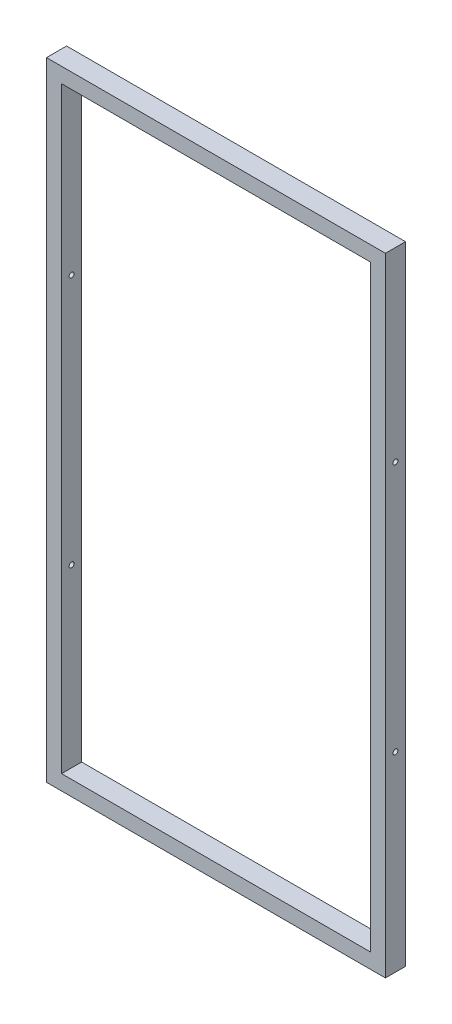
ISO-10303-21;
HEADER;
FILE_DESCRIPTION(('STEP AP214'),'2;1');
FILE_NAME('part.step','',(''),(''),'','','');
FILE_SCHEMA(('AUTOMOTIVE_DESIGN { 1 0 10303 214 1 1 1 1 }'));
ENDSEC;
DATA;
#1=APPLICATION_CONTEXT('core data for automotive mechanical design processes');
#2=APPLICATION_PROTOCOL_DEFINITION('international standard','automotive_design',2000,#1);
#3=PRODUCT_CONTEXT('',#1,'mechanical');
#4=PRODUCT('Part','Part','',(#3));
#5=PRODUCT_RELATED_PRODUCT_CATEGORY('part','',(#4));
#6=PRODUCT_DEFINITION_FORMATION('','',#4);
#7=PRODUCT_DEFINITION_CONTEXT('part definition',#1,'design');
#8=PRODUCT_DEFINITION('design','',#6,#7);
#9=PRODUCT_DEFINITION_SHAPE('','',#8);
#10=(LENGTH_UNIT() NAMED_UNIT(*) SI_UNIT(.MILLI.,.METRE.));
#11=(NAMED_UNIT(*) PLANE_ANGLE_UNIT() SI_UNIT($,.RADIAN.));
#12=(NAMED_UNIT(*) SI_UNIT($,.STERADIAN.) SOLID_ANGLE_UNIT());
#13=UNCERTAINTY_MEASURE_WITH_UNIT(LENGTH_MEASURE(1.E-05),#10,'distance_accuracy_value','');
#14=(GEOMETRIC_REPRESENTATION_CONTEXT(3) GLOBAL_UNCERTAINTY_ASSIGNED_CONTEXT((#13)) GLOBAL_UNIT_ASSIGNED_CONTEXT((#10,
#11,#12)) REPRESENTATION_CONTEXT('',''));
#15=CARTESIAN_POINT('',(0.,0.,0.));
#16=DIRECTION('',(0.,0.,1.));
#17=DIRECTION('',(1.,0.,0.));
#18=AXIS2_PLACEMENT_3D('',#15,#16,#17);
#19=CARTESIAN_POINT('',(0.,0.,40.));
#20=DIRECTION('',(0.,0.,1.));
#21=DIRECTION('',(1.,0.,0.));
#22=AXIS2_PLACEMENT_3D('',#19,#20,#21);
#23=PLANE('',#22);
#24=DIRECTION('',(-1.,0.,0.));
#25=VECTOR('',#24,1.);
#26=CARTESIAN_POINT('',(604.301582524873,1211.13152818773,40.));
#27=LINE('',#26,#25);
#28=CARTESIAN_POINT('',(604.301582524873,1211.13152818773,40.));
#29=VERTEX_POINT('',#28);
#30=CARTESIAN_POINT('',(-70.6984174751271,1211.13152818773,40.));
#31=VERTEX_POINT('',#30);
#32=EDGE_CURVE('E141',#29,#31,#27,.T.);
#33=ORIENTED_EDGE('',*,*,#32,.T.);
#34=DIRECTION('',(0.,-1.,0.));
#35=VECTOR('',#34,1.);
#36=CARTESIAN_POINT('',(-70.6984174751271,1211.13152818773,40.));
#37=LINE('',#36,#35);
#38=CARTESIAN_POINT('',(-70.6984174751269,-38.8684718122674,40.));
#39=VERTEX_POINT('',#38);
#40=EDGE_CURVE('E144',#31,#39,#37,.T.);
#41=ORIENTED_EDGE('',*,*,#40,.T.);
#42=DIRECTION('',(1.,0.,0.));
#43=VECTOR('',#42,1.);
#44=CARTESIAN_POINT('',(-70.6984174751269,-38.8684718122674,40.));
#45=LINE('',#44,#43);
#46=CARTESIAN_POINT('',(604.301582524873,-38.8684718122674,40.));
#47=VERTEX_POINT('',#46);
#48=EDGE_CURVE('E147',#39,#47,#45,.T.);
#49=ORIENTED_EDGE('',*,*,#48,.T.);
#50=DIRECTION('',(0.,1.,0.));
#51=VECTOR('',#50,1.);
#52=CARTESIAN_POINT('',(604.301582524873,-38.8684718122674,40.));
#53=LINE('',#52,#51);
#54=EDGE_CURVE('E149',#47,#29,#53,.T.);
#55=ORIENTED_EDGE('',*,*,#54,.T.);
#56=EDGE_LOOP('',(#33,#41,#49,#55));
#57=FACE_BOUND('',#56,.T.);
#58=DIRECTION('',(0.,-1.,0.));
#59=VECTOR('',#58,1.);
#60=CARTESIAN_POINT('',(-40.6984174751271,1181.13152818773,40.));
#61=LINE('',#60,#59);
#62=CARTESIAN_POINT('',(-40.6984174751271,1181.13152818773,40.));
#63=VERTEX_POINT('',#62);
#64=CARTESIAN_POINT('',(-40.6984174751269,-8.86847181226735,40.));
#65=VERTEX_POINT('',#64);
#66=EDGE_CURVE('E111',#63,#65,#61,.T.);
#67=ORIENTED_EDGE('',*,*,#66,.F.);
#68=DIRECTION('',(-1.,0.,0.));
#69=VECTOR('',#68,1.);
#70=CARTESIAN_POINT('',(574.301582524873,1181.13152818773,40.));
#71=LINE('',#70,#69);
#72=CARTESIAN_POINT('',(574.301582524873,1181.13152818773,40.));
#73=VERTEX_POINT('',#72);
#74=EDGE_CURVE('E103',#73,#63,#71,.T.);
#75=ORIENTED_EDGE('',*,*,#74,.F.);
#76=DIRECTION('',(0.,1.,0.));
#77=VECTOR('',#76,1.);
#78=CARTESIAN_POINT('',(574.301582524873,-8.86847181226735,40.));
#79=LINE('',#78,#77);
#80=CARTESIAN_POINT('',(574.301582524873,-8.86847181226735,40.));
#81=VERTEX_POINT('',#80);
#82=EDGE_CURVE('E125',#81,#73,#79,.T.);
#83=ORIENTED_EDGE('',*,*,#82,.F.);
#84=DIRECTION('',(1.,0.,0.));
#85=VECTOR('',#84,1.);
#86=CARTESIAN_POINT('',(-40.6984174751269,-8.86847181226735,40.));
#87=LINE('',#86,#85);
#88=EDGE_CURVE('E123',#65,#81,#87,.T.);
#89=ORIENTED_EDGE('',*,*,#88,.F.);
#90=EDGE_LOOP('',(#67,#75,#83,#89));
#91=FACE_BOUND('',#90,.T.);
#92=ADVANCED_FACE('F36',(#57,#91),#23,.T.);
#93=CARTESIAN_POINT('',(0.,0.,0.));
#94=DIRECTION('',(0.,0.,1.));
#95=DIRECTION('',(1.,0.,0.));
#96=AXIS2_PLACEMENT_3D('',#93,#94,#95);
#97=PLANE('',#96);
#98=DIRECTION('',(-1.,0.,0.));
#99=VECTOR('',#98,1.);
#100=CARTESIAN_POINT('',(604.301582524873,1211.13152818773,0.));
#101=LINE('',#100,#99);
#102=CARTESIAN_POINT('',(604.301582524873,1211.13152818773,0.));
#103=VERTEX_POINT('',#102);
#104=CARTESIAN_POINT('',(-70.6984174751271,1211.13152818773,0.));
#105=VERTEX_POINT('',#104);
#106=EDGE_CURVE('E119',#103,#105,#101,.T.);
#107=ORIENTED_EDGE('',*,*,#106,.F.);
#108=DIRECTION('',(0.,1.,0.));
#109=VECTOR('',#108,1.);
#110=CARTESIAN_POINT('',(604.301582524873,-38.8684718122674,0.));
#111=LINE('',#110,#109);
#112=CARTESIAN_POINT('',(604.301582524873,-38.8684718122674,0.));
#113=VERTEX_POINT('',#112);
#114=EDGE_CURVE('E145',#113,#103,#111,.T.);
#115=ORIENTED_EDGE('',*,*,#114,.F.);
#116=DIRECTION('',(1.,0.,0.));
#117=VECTOR('',#116,1.);
#118=CARTESIAN_POINT('',(-70.6984174751269,-38.8684718122674,0.));
#119=LINE('',#118,#117);
#120=CARTESIAN_POINT('',(-70.6984174751269,-38.8684718122674,0.));
#121=VERTEX_POINT('',#120);
#122=EDGE_CURVE('E156',#121,#113,#119,.T.);
#123=ORIENTED_EDGE('',*,*,#122,.F.);
#124=DIRECTION('',(0.,-1.,0.));
#125=VECTOR('',#124,1.);
#126=CARTESIAN_POINT('',(-70.6984174751271,1211.13152818773,0.));
#127=LINE('',#126,#125);
#128=EDGE_CURVE('E154',#105,#121,#127,.T.);
#129=ORIENTED_EDGE('',*,*,#128,.F.);
#130=EDGE_LOOP('',(#107,#115,#123,#129));
#131=FACE_BOUND('',#130,.T.);
#132=DIRECTION('',(-1.,0.,0.));
#133=VECTOR('',#132,1.);
#134=CARTESIAN_POINT('',(574.301582524873,1181.13152818773,0.));
#135=LINE('',#134,#133);
#136=CARTESIAN_POINT('',(574.301582524873,1181.13152818773,0.));
#137=VERTEX_POINT('',#136);
#138=CARTESIAN_POINT('',(-40.6984174751271,1181.13152818773,0.));
#139=VERTEX_POINT('',#138);
#140=EDGE_CURVE('E61',#137,#139,#135,.T.);
#141=ORIENTED_EDGE('',*,*,#140,.T.);
#142=DIRECTION('',(0.,-1.,0.));
#143=VECTOR('',#142,1.);
#144=CARTESIAN_POINT('',(-40.6984174751271,1181.13152818773,0.));
#145=LINE('',#144,#143);
#146=CARTESIAN_POINT('',(-40.6984174751269,-8.86847181226735,0.));
#147=VERTEX_POINT('',#146);
#148=EDGE_CURVE('E118',#139,#147,#145,.T.);
#149=ORIENTED_EDGE('',*,*,#148,.T.);
#150=DIRECTION('',(1.,0.,0.));
#151=VECTOR('',#150,1.);
#152=CARTESIAN_POINT('',(-40.6984174751269,-8.86847181226735,0.));
#153=LINE('',#152,#151);
#154=CARTESIAN_POINT('',(574.301582524873,-8.86847181226735,0.));
#155=VERTEX_POINT('',#154);
#156=EDGE_CURVE('E133',#147,#155,#153,.T.);
#157=ORIENTED_EDGE('',*,*,#156,.T.);
#158=DIRECTION('',(0.,1.,0.));
#159=VECTOR('',#158,1.);
#160=CARTESIAN_POINT('',(574.301582524873,-8.86847181226735,0.));
#161=LINE('',#160,#159);
#162=EDGE_CURVE('E112',#155,#137,#161,.T.);
#163=ORIENTED_EDGE('',*,*,#162,.T.);
#164=EDGE_LOOP('',(#141,#149,#157,#163));
#165=FACE_BOUND('',#164,.T.);
#166=ADVANCED_FACE('F203',(#131,#165),#97,.F.);
#167=CARTESIAN_POINT('',(604.301582524873,1211.13152818773,40.));
#168=DIRECTION('',(0.,-1.,0.));
#169=DIRECTION('',(0.,0.,-1.));
#170=AXIS2_PLACEMENT_3D('',#167,#168,#169);
#171=PLANE('',#170);
#172=ORIENTED_EDGE('',*,*,#106,.T.);
#173=DIRECTION('',(0.,0.,-1.));
#174=VECTOR('',#173,1.);
#175=CARTESIAN_POINT('',(-70.6984174751271,1211.13152818773,40.));
#176=LINE('',#175,#174);
#177=EDGE_CURVE('E11',#31,#105,#176,.T.);
#178=ORIENTED_EDGE('',*,*,#177,.F.);
#179=ORIENTED_EDGE('',*,*,#32,.F.);
#180=DIRECTION('',(0.,0.,-1.));
#181=VECTOR('',#180,1.);
#182=CARTESIAN_POINT('',(604.301582524873,1211.13152818773,40.));
#183=LINE('',#182,#181);
#184=EDGE_CURVE('E151',#29,#103,#183,.T.);
#185=ORIENTED_EDGE('',*,*,#184,.T.);
#186=EDGE_LOOP('',(#172,#178,#179,#185));
#187=FACE_BOUND('',#186,.T.);
#188=ADVANCED_FACE('F38',(#187),#171,.F.);
#189=CARTESIAN_POINT('',(-70.6984174751271,1211.13152818773,40.));
#190=DIRECTION('',(1.,0.,0.));
#191=DIRECTION('',(0.,1.,0.));
#192=AXIS2_PLACEMENT_3D('',#189,#190,#191);
#193=PLANE('',#192);
#194=CARTESIAN_POINT('',(-70.6984174751272,341.131528187732,20.));
#195=DIRECTION('',(1.,0.,0.));
#196=DIRECTION('',(0.,1.,0.));
#197=AXIS2_PLACEMENT_3D('',#194,#195,#196);
#198=CIRCLE('',#197,4.99999999999999);
#199=CARTESIAN_POINT('',(-70.6984174751272,346.131528187732,20.));
#200=VERTEX_POINT('',#199);
#201=EDGE_CURVE('E185',#200,#200,#198,.T.);
#202=ORIENTED_EDGE('',*,*,#201,.T.);
#203=EDGE_LOOP('',(#202));
#204=FACE_BOUND('',#203,.T.);
#205=CARTESIAN_POINT('',(-70.6984174751273,841.131528187732,20.0000000000002));
#206=DIRECTION('',(1.,0.,0.));
#207=DIRECTION('',(0.,1.,0.));
#208=AXIS2_PLACEMENT_3D('',#205,#206,#207);
#209=CIRCLE('',#208,5.);
#210=CARTESIAN_POINT('',(-70.6984174751273,846.131528187732,20.0000000000002));
#211=VERTEX_POINT('',#210);
#212=EDGE_CURVE('E167',#211,#211,#209,.T.);
#213=ORIENTED_EDGE('',*,*,#212,.T.);
#214=EDGE_LOOP('',(#213));
#215=FACE_BOUND('',#214,.T.);
#216=ORIENTED_EDGE('',*,*,#128,.T.);
#217=DIRECTION('',(0.,0.,-1.));
#218=VECTOR('',#217,1.);
#219=CARTESIAN_POINT('',(-70.6984174751269,-38.8684718122674,40.));
#220=LINE('',#219,#218);
#221=EDGE_CURVE('E45',#39,#121,#220,.T.);
#222=ORIENTED_EDGE('',*,*,#221,.F.);
#223=ORIENTED_EDGE('',*,*,#40,.F.);
#224=ORIENTED_EDGE('',*,*,#177,.T.);
#225=EDGE_LOOP('',(#216,#222,#223,#224));
#226=FACE_BOUND('',#225,.T.);
#227=ADVANCED_FACE('F228',(#204,#215,#226),#193,.F.);
#228=CARTESIAN_POINT('',(-70.6984174751269,-38.8684718122674,40.));
#229=DIRECTION('',(0.,1.,0.));
#230=DIRECTION('',(0.,0.,1.));
#231=AXIS2_PLACEMENT_3D('',#228,#229,#230);
#232=PLANE('',#231);
#233=ORIENTED_EDGE('',*,*,#122,.T.);
#234=DIRECTION('',(0.,0.,-1.));
#235=VECTOR('',#234,1.);
#236=CARTESIAN_POINT('',(604.301582524873,-38.8684718122674,40.));
#237=LINE('',#236,#235);
#238=EDGE_CURVE('E161',#47,#113,#237,.T.);
#239=ORIENTED_EDGE('',*,*,#238,.F.);
#240=ORIENTED_EDGE('',*,*,#48,.F.);
#241=ORIENTED_EDGE('',*,*,#221,.T.);
#242=EDGE_LOOP('',(#233,#239,#240,#241));
#243=FACE_BOUND('',#242,.T.);
#244=ADVANCED_FACE('F225',(#243),#232,.F.);
#245=CARTESIAN_POINT('',(604.301582524873,-38.8684718122674,40.));
#246=DIRECTION('',(-1.,0.,0.));
#247=DIRECTION('',(0.,0.,1.));
#248=AXIS2_PLACEMENT_3D('',#245,#246,#247);
#249=PLANE('',#248);
#250=CARTESIAN_POINT('',(604.301582524873,341.131528187732,20.));
#251=DIRECTION('',(1.,0.,0.));
#252=DIRECTION('',(0.,1.,0.));
#253=AXIS2_PLACEMENT_3D('',#250,#251,#252);
#254=CIRCLE('',#253,4.99999999999999);
#255=CARTESIAN_POINT('',(604.301582524873,346.131528187732,20.));
#256=VERTEX_POINT('',#255);
#257=EDGE_CURVE('E182',#256,#256,#254,.T.);
#258=ORIENTED_EDGE('',*,*,#257,.F.);
#259=EDGE_LOOP('',(#258));
#260=FACE_BOUND('',#259,.T.);
#261=CARTESIAN_POINT('',(604.301582524873,841.131528187733,20.0000000000002));
#262=DIRECTION('',(1.,0.,0.));
#263=DIRECTION('',(0.,1.,0.));
#264=AXIS2_PLACEMENT_3D('',#261,#262,#263);
#265=CIRCLE('',#264,5.);
#266=CARTESIAN_POINT('',(604.301582524873,846.131528187733,20.0000000000002));
#267=VERTEX_POINT('',#266);
#268=EDGE_CURVE('E172',#267,#267,#265,.T.);
#269=ORIENTED_EDGE('',*,*,#268,.F.);
#270=EDGE_LOOP('',(#269));
#271=FACE_BOUND('',#270,.T.);
#272=ORIENTED_EDGE('',*,*,#114,.T.);
#273=ORIENTED_EDGE('',*,*,#184,.F.);
#274=ORIENTED_EDGE('',*,*,#54,.F.);
#275=ORIENTED_EDGE('',*,*,#238,.T.);
#276=EDGE_LOOP('',(#272,#273,#274,#275));
#277=FACE_BOUND('',#276,.T.);
#278=ADVANCED_FACE('F222',(#260,#271,#277),#249,.F.);
#279=CARTESIAN_POINT('',(574.301582524873,1181.13152818773,40.));
#280=DIRECTION('',(0.,-1.,0.));
#281=DIRECTION('',(0.,0.,-1.));
#282=AXIS2_PLACEMENT_3D('',#279,#280,#281);
#283=PLANE('',#282);
#284=ORIENTED_EDGE('',*,*,#140,.F.);
#285=DIRECTION('',(0.,0.,-1.));
#286=VECTOR('',#285,1.);
#287=CARTESIAN_POINT('',(574.301582524873,1181.13152818773,40.));
#288=LINE('',#287,#286);
#289=EDGE_CURVE('E107',#73,#137,#288,.T.);
#290=ORIENTED_EDGE('',*,*,#289,.F.);
#291=ORIENTED_EDGE('',*,*,#74,.T.);
#292=DIRECTION('',(0.,0.,-1.));
#293=VECTOR('',#292,1.);
#294=CARTESIAN_POINT('',(-40.6984174751271,1181.13152818773,40.));
#295=LINE('',#294,#293);
#296=EDGE_CURVE('E106',#63,#139,#295,.T.);
#297=ORIENTED_EDGE('',*,*,#296,.T.);
#298=EDGE_LOOP('',(#284,#290,#291,#297));
#299=FACE_BOUND('',#298,.T.);
#300=ADVANCED_FACE('F105',(#299),#283,.T.);
#301=CARTESIAN_POINT('',(-40.6984174751271,1181.13152818773,40.));
#302=DIRECTION('',(1.,0.,0.));
#303=DIRECTION('',(0.,1.,0.));
#304=AXIS2_PLACEMENT_3D('',#301,#302,#303);
#305=PLANE('',#304);
#306=CARTESIAN_POINT('',(-40.698417475127,341.131528187732,20.));
#307=DIRECTION('',(1.,0.,0.));
#308=DIRECTION('',(0.,1.,0.));
#309=AXIS2_PLACEMENT_3D('',#306,#307,#308);
#310=CIRCLE('',#309,4.99999999999999);
#311=CARTESIAN_POINT('',(-40.698417475127,346.131528187732,20.));
#312=VERTEX_POINT('',#311);
#313=EDGE_CURVE('E177',#312,#312,#310,.T.);
#314=ORIENTED_EDGE('',*,*,#313,.F.);
#315=EDGE_LOOP('',(#314));
#316=FACE_BOUND('',#315,.T.);
#317=CARTESIAN_POINT('',(-40.698417475127,841.131528187732,20.0000000000002));
#318=DIRECTION('',(1.,0.,0.));
#319=DIRECTION('',(0.,1.,0.));
#320=AXIS2_PLACEMENT_3D('',#317,#318,#319);
#321=CIRCLE('',#320,5.);
#322=CARTESIAN_POINT('',(-40.698417475127,846.131528187732,20.0000000000002));
#323=VERTEX_POINT('',#322);
#324=EDGE_CURVE('E131',#323,#323,#321,.T.);
#325=ORIENTED_EDGE('',*,*,#324,.F.);
#326=EDGE_LOOP('',(#325));
#327=FACE_BOUND('',#326,.T.);
#328=ORIENTED_EDGE('',*,*,#148,.F.);
#329=ORIENTED_EDGE('',*,*,#296,.F.);
#330=ORIENTED_EDGE('',*,*,#66,.T.);
#331=DIRECTION('',(0.,0.,-1.));
#332=VECTOR('',#331,1.);
#333=CARTESIAN_POINT('',(-40.6984174751269,-8.86847181226735,40.));
#334=LINE('',#333,#332);
#335=EDGE_CURVE('E120',#65,#147,#334,.T.);
#336=ORIENTED_EDGE('',*,*,#335,.T.);
#337=EDGE_LOOP('',(#328,#329,#330,#336));
#338=FACE_BOUND('',#337,.T.);
#339=ADVANCED_FACE('F115',(#316,#327,#338),#305,.T.);
#340=CARTESIAN_POINT('',(-40.6984174751269,-8.86847181226735,40.));
#341=DIRECTION('',(0.,1.,0.));
#342=DIRECTION('',(0.,0.,1.));
#343=AXIS2_PLACEMENT_3D('',#340,#341,#342);
#344=PLANE('',#343);
#345=ORIENTED_EDGE('',*,*,#156,.F.);
#346=ORIENTED_EDGE('',*,*,#335,.F.);
#347=ORIENTED_EDGE('',*,*,#88,.T.);
#348=DIRECTION('',(0.,0.,-1.));
#349=VECTOR('',#348,1.);
#350=CARTESIAN_POINT('',(574.301582524873,-8.86847181226735,40.));
#351=LINE('',#350,#349);
#352=EDGE_CURVE('E53',#81,#155,#351,.T.);
#353=ORIENTED_EDGE('',*,*,#352,.T.);
#354=EDGE_LOOP('',(#345,#346,#347,#353));
#355=FACE_BOUND('',#354,.T.);
#356=ADVANCED_FACE('F199',(#355),#344,.T.);
#357=CARTESIAN_POINT('',(574.301582524873,-8.86847181226735,40.));
#358=DIRECTION('',(-1.,0.,0.));
#359=DIRECTION('',(0.,0.,1.));
#360=AXIS2_PLACEMENT_3D('',#357,#358,#359);
#361=PLANE('',#360);
#362=CARTESIAN_POINT('',(574.301582524873,341.131528187732,20.));
#363=DIRECTION('',(-1.,0.,0.));
#364=DIRECTION('',(0.,0.,1.));
#365=AXIS2_PLACEMENT_3D('',#362,#363,#364);
#366=CIRCLE('',#365,4.99999999999999);
#367=CARTESIAN_POINT('',(574.301582524873,341.131528187732,25.));
#368=VERTEX_POINT('',#367);
#369=EDGE_CURVE('E40',#368,#368,#366,.T.);
#370=ORIENTED_EDGE('',*,*,#369,.F.);
#371=EDGE_LOOP('',(#370));
#372=FACE_BOUND('',#371,.T.);
#373=CARTESIAN_POINT('',(574.301582524873,841.131528187733,20.0000000000002));
#374=DIRECTION('',(-1.,0.,0.));
#375=DIRECTION('',(0.,0.,1.));
#376=AXIS2_PLACEMENT_3D('',#373,#374,#375);
#377=CIRCLE('',#376,5.);
#378=CARTESIAN_POINT('',(574.301582524873,841.131528187733,25.0000000000002));
#379=VERTEX_POINT('',#378);
#380=EDGE_CURVE('E165',#379,#379,#377,.T.);
#381=ORIENTED_EDGE('',*,*,#380,.F.);
#382=EDGE_LOOP('',(#381));
#383=FACE_BOUND('',#382,.T.);
#384=ORIENTED_EDGE('',*,*,#162,.F.);
#385=ORIENTED_EDGE('',*,*,#352,.F.);
#386=ORIENTED_EDGE('',*,*,#82,.T.);
#387=ORIENTED_EDGE('',*,*,#289,.T.);
#388=EDGE_LOOP('',(#384,#385,#386,#387));
#389=FACE_BOUND('',#388,.T.);
#390=ADVANCED_FACE('F195',(#372,#383,#389),#361,.T.);
#391=CARTESIAN_POINT('',(-70.6984174751273,841.131528187732,20.0000000000002));
#392=DIRECTION('',(1.,0.,0.));
#393=DIRECTION('',(0.,1.,0.));
#394=AXIS2_PLACEMENT_3D('',#391,#392,#393);
#395=CYLINDRICAL_SURFACE('',#394,5.);
#396=ORIENTED_EDGE('',*,*,#380,.T.);
#397=EDGE_LOOP('',(#396));
#398=FACE_BOUND('',#397,.T.);
#399=ORIENTED_EDGE('',*,*,#268,.T.);
#400=EDGE_LOOP('',(#399));
#401=FACE_BOUND('',#400,.T.);
#402=ADVANCED_FACE('F198',(#398,#401),#395,.F.);
#403=ORIENTED_EDGE('',*,*,#324,.T.);
#404=EDGE_LOOP('',(#403));
#405=FACE_BOUND('',#404,.T.);
#406=ORIENTED_EDGE('',*,*,#212,.F.);
#407=EDGE_LOOP('',(#406));
#408=FACE_BOUND('',#407,.T.);
#409=ADVANCED_FACE('F303',(#405,#408),#395,.F.);
#410=CARTESIAN_POINT('',(-70.6984174751272,341.131528187732,20.));
#411=DIRECTION('',(1.,0.,0.));
#412=DIRECTION('',(0.,1.,0.));
#413=AXIS2_PLACEMENT_3D('',#410,#411,#412);
#414=CYLINDRICAL_SURFACE('',#413,4.99999999999999);
#415=ORIENTED_EDGE('',*,*,#369,.T.);
#416=EDGE_LOOP('',(#415));
#417=FACE_BOUND('',#416,.T.);
#418=ORIENTED_EDGE('',*,*,#257,.T.);
#419=EDGE_LOOP('',(#418));
#420=FACE_BOUND('',#419,.T.);
#421=ADVANCED_FACE('F192',(#417,#420),#414,.F.);
#422=ORIENTED_EDGE('',*,*,#313,.T.);
#423=EDGE_LOOP('',(#422));
#424=FACE_BOUND('',#423,.T.);
#425=ORIENTED_EDGE('',*,*,#201,.F.);
#426=EDGE_LOOP('',(#425));
#427=FACE_BOUND('',#426,.T.);
#428=ADVANCED_FACE('F318',(#424,#427),#414,.F.);
#429=CLOSED_SHELL('',(#92,#166,#188,#227,#244,#278,#300,#339,#356,#390,#402,#409,#421,#428));
#430=MANIFOLD_SOLID_BREP('B2',#429);
#431=ADVANCED_BREP_SHAPE_REPRESENTATION('',(#18,#430),#14);
#432=SHAPE_DEFINITION_REPRESENTATION(#9,#431);
ENDSEC;
END-ISO-10303-21;
